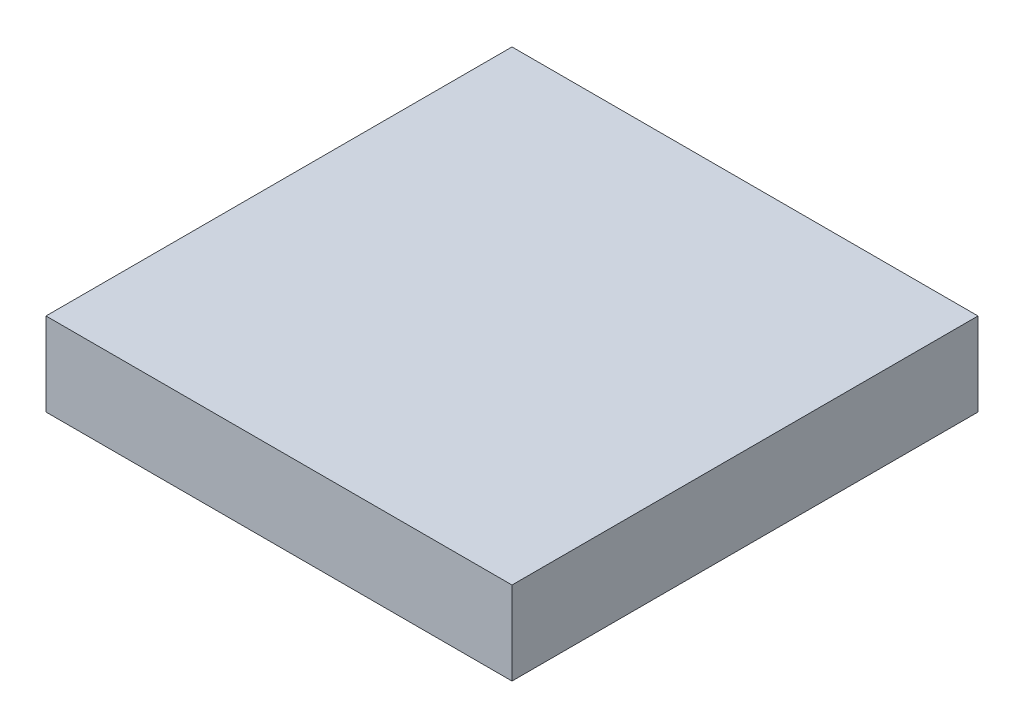
ISO-10303-21;
HEADER;
FILE_DESCRIPTION(('STEP AP214'),'2;1');
FILE_NAME('part.step','',(''),(''),'','','');
FILE_SCHEMA(('AUTOMOTIVE_DESIGN { 1 0 10303 214 1 1 1 1 }'));
ENDSEC;
DATA;
#1=APPLICATION_CONTEXT('core data for automotive mechanical design processes');
#2=APPLICATION_PROTOCOL_DEFINITION('international standard','automotive_design',2000,#1);
#3=PRODUCT_CONTEXT('',#1,'mechanical');
#4=PRODUCT('Part','Part','',(#3));
#5=PRODUCT_RELATED_PRODUCT_CATEGORY('part','',(#4));
#6=PRODUCT_DEFINITION_FORMATION('','',#4);
#7=PRODUCT_DEFINITION_CONTEXT('part definition',#1,'design');
#8=PRODUCT_DEFINITION('design','',#6,#7);
#9=PRODUCT_DEFINITION_SHAPE('','',#8);
#10=(LENGTH_UNIT() NAMED_UNIT(*) SI_UNIT(.MILLI.,.METRE.));
#11=(NAMED_UNIT(*) PLANE_ANGLE_UNIT() SI_UNIT($,.RADIAN.));
#12=(NAMED_UNIT(*) SI_UNIT($,.STERADIAN.) SOLID_ANGLE_UNIT());
#13=UNCERTAINTY_MEASURE_WITH_UNIT(LENGTH_MEASURE(1.E-05),#10,'distance_accuracy_value','');
#14=(GEOMETRIC_REPRESENTATION_CONTEXT(3) GLOBAL_UNCERTAINTY_ASSIGNED_CONTEXT((#13)) GLOBAL_UNIT_ASSIGNED_CONTEXT((#10,
#11,#12)) REPRESENTATION_CONTEXT('',''));
#15=CARTESIAN_POINT('',(0.,0.,0.));
#16=DIRECTION('',(0.,0.,1.));
#17=DIRECTION('',(1.,0.,0.));
#18=AXIS2_PLACEMENT_3D('',#15,#16,#17);
#19=CARTESIAN_POINT('',(-1.39999974,0.2499995,0.));
#20=DIRECTION('',(0.,1.,0.));
#21=DIRECTION('',(0.,0.,1.));
#22=AXIS2_PLACEMENT_3D('',#19,#20,#21);
#23=PLANE('',#22);
#24=DIRECTION('',(0.,0.,-1.));
#25=VECTOR('',#24,1.);
#26=CARTESIAN_POINT('',(1.39999974,0.2499995,0.));
#27=LINE('',#26,#25);
#28=CARTESIAN_POINT('',(1.39999974,0.2499995,0.));
#29=VERTEX_POINT('',#28);
#30=CARTESIAN_POINT('',(1.39999974,0.2499995,2.79999948));
#31=VERTEX_POINT('',#30);
#32=EDGE_CURVE('E20',#29,#31,#27,.F.);
#33=ORIENTED_EDGE('',*,*,#32,.F.);
#34=DIRECTION('',(1.,0.,0.));
#35=VECTOR('',#34,1.);
#36=CARTESIAN_POINT('',(1.39999974,0.2499995,0.));
#37=LINE('',#36,#35);
#38=CARTESIAN_POINT('',(-1.39999974,0.2499995,0.));
#39=VERTEX_POINT('',#38);
#40=EDGE_CURVE('E80',#29,#39,#37,.F.);
#41=ORIENTED_EDGE('',*,*,#40,.T.);
#42=DIRECTION('',(0.,0.,1.));
#43=VECTOR('',#42,1.);
#44=CARTESIAN_POINT('',(-1.39999974,0.2499995,0.));
#45=LINE('',#44,#43);
#46=CARTESIAN_POINT('',(-1.39999974,0.2499995,2.79999948));
#47=VERTEX_POINT('',#46);
#48=EDGE_CURVE('E68',#47,#39,#45,.F.);
#49=ORIENTED_EDGE('',*,*,#48,.F.);
#50=DIRECTION('',(1.,0.,0.));
#51=VECTOR('',#50,1.);
#52=CARTESIAN_POINT('',(1.39999974,0.2499995,2.79999948));
#53=LINE('',#52,#51);
#54=EDGE_CURVE('E56',#31,#47,#53,.F.);
#55=ORIENTED_EDGE('',*,*,#54,.F.);
#56=EDGE_LOOP('',(#33,#41,#49,#55));
#57=FACE_BOUND('',#56,.T.);
#58=ADVANCED_FACE('F17',(#57),#23,.T.);
#59=CARTESIAN_POINT('',(1.39999974,0.2499995,0.));
#60=DIRECTION('',(1.,0.,0.));
#61=DIRECTION('',(0.,0.,-1.));
#62=AXIS2_PLACEMENT_3D('',#59,#60,#61);
#63=PLANE('',#62);
#64=DIRECTION('',(0.,0.,-1.));
#65=VECTOR('',#64,1.);
#66=CARTESIAN_POINT('',(1.39999974,-0.2499995,0.));
#67=LINE('',#66,#65);
#68=CARTESIAN_POINT('',(1.39999974,-0.2499995,0.));
#69=VERTEX_POINT('',#68);
#70=CARTESIAN_POINT('',(1.39999974,-0.2499995,2.79999948));
#71=VERTEX_POINT('',#70);
#72=EDGE_CURVE('E83',#69,#71,#67,.F.);
#73=ORIENTED_EDGE('',*,*,#72,.F.);
#74=DIRECTION('',(0.,1.,0.));
#75=VECTOR('',#74,1.);
#76=CARTESIAN_POINT('',(1.39999974,-0.2499995,0.));
#77=LINE('',#76,#75);
#78=EDGE_CURVE('E65',#69,#29,#77,.T.);
#79=ORIENTED_EDGE('',*,*,#78,.T.);
#80=ORIENTED_EDGE('',*,*,#32,.T.);
#81=DIRECTION('',(0.,1.,0.));
#82=VECTOR('',#81,1.);
#83=CARTESIAN_POINT('',(1.39999974,-0.2499995,2.79999948));
#84=LINE('',#83,#82);
#85=EDGE_CURVE('E62',#71,#31,#84,.T.);
#86=ORIENTED_EDGE('',*,*,#85,.F.);
#87=EDGE_LOOP('',(#73,#79,#80,#86));
#88=FACE_BOUND('',#87,.T.);
#89=ADVANCED_FACE('F61',(#88),#63,.T.);
#90=CARTESIAN_POINT('',(1.39999974,-0.2499995,2.79999948));
#91=DIRECTION('',(0.,0.,1.));
#92=DIRECTION('',(1.,0.,0.));
#93=AXIS2_PLACEMENT_3D('',#90,#91,#92);
#94=PLANE('',#93);
#95=DIRECTION('',(0.,1.,0.));
#96=VECTOR('',#95,1.);
#97=CARTESIAN_POINT('',(-1.39999974,-0.2499995,2.79999948));
#98=LINE('',#97,#96);
#99=CARTESIAN_POINT('',(-1.39999974,-0.2499995,2.79999948));
#100=VERTEX_POINT('',#99);
#101=EDGE_CURVE('E70',#100,#47,#98,.T.);
#102=ORIENTED_EDGE('',*,*,#101,.F.);
#103=DIRECTION('',(1.,0.,0.));
#104=VECTOR('',#103,1.);
#105=CARTESIAN_POINT('',(1.39999974,-0.2499995,2.79999948));
#106=LINE('',#105,#104);
#107=EDGE_CURVE('E74',#71,#100,#106,.F.);
#108=ORIENTED_EDGE('',*,*,#107,.F.);
#109=ORIENTED_EDGE('',*,*,#85,.T.);
#110=ORIENTED_EDGE('',*,*,#54,.T.);
#111=EDGE_LOOP('',(#102,#108,#109,#110));
#112=FACE_BOUND('',#111,.T.);
#113=ADVANCED_FACE('F72',(#112),#94,.T.);
#114=CARTESIAN_POINT('',(-1.39999974,-0.2499995,0.));
#115=DIRECTION('',(-1.,0.,0.));
#116=DIRECTION('',(0.,0.,1.));
#117=AXIS2_PLACEMENT_3D('',#114,#115,#116);
#118=PLANE('',#117);
#119=ORIENTED_EDGE('',*,*,#48,.T.);
#120=DIRECTION('',(0.,1.,0.));
#121=VECTOR('',#120,1.);
#122=CARTESIAN_POINT('',(-1.39999974,-0.2499995,0.));
#123=LINE('',#122,#121);
#124=CARTESIAN_POINT('',(-1.39999974,-0.2499995,0.));
#125=VERTEX_POINT('',#124);
#126=EDGE_CURVE('E35',#39,#125,#123,.F.);
#127=ORIENTED_EDGE('',*,*,#126,.T.);
#128=DIRECTION('',(0.,0.,-1.));
#129=VECTOR('',#128,1.);
#130=CARTESIAN_POINT('',(-1.39999974,-0.2499995,0.));
#131=LINE('',#130,#129);
#132=EDGE_CURVE('E26',#100,#125,#131,.T.);
#133=ORIENTED_EDGE('',*,*,#132,.F.);
#134=ORIENTED_EDGE('',*,*,#101,.T.);
#135=EDGE_LOOP('',(#119,#127,#133,#134));
#136=FACE_BOUND('',#135,.T.);
#137=ADVANCED_FACE('F89',(#136),#118,.T.);
#138=CARTESIAN_POINT('',(1.39999974,-0.2499995,0.));
#139=DIRECTION('',(0.,0.,1.));
#140=DIRECTION('',(1.,0.,0.));
#141=AXIS2_PLACEMENT_3D('',#138,#139,#140);
#142=PLANE('',#141);
#143=ORIENTED_EDGE('',*,*,#126,.F.);
#144=ORIENTED_EDGE('',*,*,#40,.F.);
#145=ORIENTED_EDGE('',*,*,#78,.F.);
#146=DIRECTION('',(1.,0.,0.));
#147=VECTOR('',#146,1.);
#148=CARTESIAN_POINT('',(1.39999974,-0.2499995,0.));
#149=LINE('',#148,#147);
#150=EDGE_CURVE('E11',#125,#69,#149,.T.);
#151=ORIENTED_EDGE('',*,*,#150,.F.);
#152=EDGE_LOOP('',(#143,#144,#145,#151));
#153=FACE_BOUND('',#152,.T.);
#154=ADVANCED_FACE('F91',(#153),#142,.F.);
#155=CARTESIAN_POINT('',(1.39999974,-0.2499995,0.));
#156=DIRECTION('',(0.,-1.,0.));
#157=DIRECTION('',(0.,0.,-1.));
#158=AXIS2_PLACEMENT_3D('',#155,#156,#157);
#159=PLANE('',#158);
#160=ORIENTED_EDGE('',*,*,#132,.T.);
#161=ORIENTED_EDGE('',*,*,#150,.T.);
#162=ORIENTED_EDGE('',*,*,#72,.T.);
#163=ORIENTED_EDGE('',*,*,#107,.T.);
#164=EDGE_LOOP('',(#160,#161,#162,#163));
#165=FACE_BOUND('',#164,.T.);
#166=ADVANCED_FACE('F88',(#165),#159,.T.);
#167=CLOSED_SHELL('',(#58,#89,#113,#137,#154,#166));
#168=MANIFOLD_SOLID_BREP('B1',#167);
#169=ADVANCED_BREP_SHAPE_REPRESENTATION('',(#18,#168),#14);
#170=SHAPE_DEFINITION_REPRESENTATION(#9,#169);
ENDSEC;
END-ISO-10303-21;
